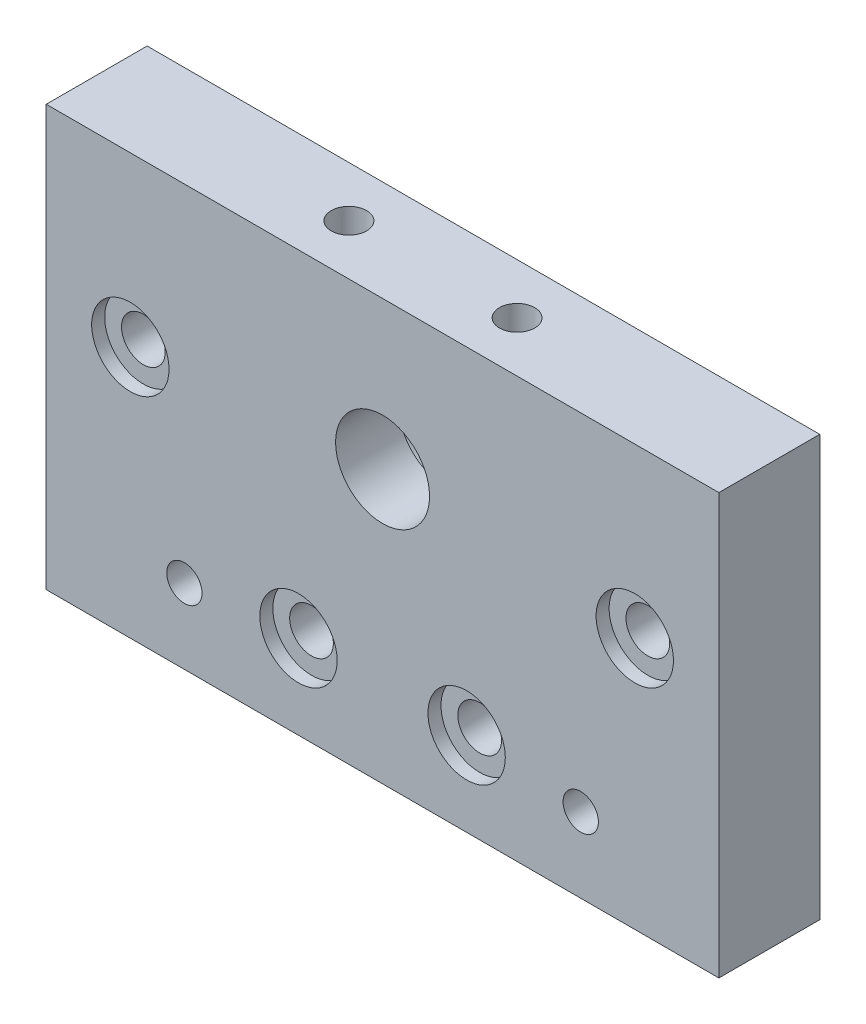
ISO-10303-21;
HEADER;
FILE_DESCRIPTION(('STEP AP214'),'2;1');
FILE_NAME('part.step','',(''),(''),'','','');
FILE_SCHEMA(('AUTOMOTIVE_DESIGN { 1 0 10303 214 1 1 1 1 }'));
ENDSEC;
DATA;
#1=APPLICATION_CONTEXT('core data for automotive mechanical design processes');
#2=APPLICATION_PROTOCOL_DEFINITION('international standard','automotive_design',2000,#1);
#3=PRODUCT_CONTEXT('',#1,'mechanical');
#4=PRODUCT('Part','Part','',(#3));
#5=PRODUCT_RELATED_PRODUCT_CATEGORY('part','',(#4));
#6=PRODUCT_DEFINITION_FORMATION('','',#4);
#7=PRODUCT_DEFINITION_CONTEXT('part definition',#1,'design');
#8=PRODUCT_DEFINITION('design','',#6,#7);
#9=PRODUCT_DEFINITION_SHAPE('','',#8);
#10=(LENGTH_UNIT() NAMED_UNIT(*) SI_UNIT(.MILLI.,.METRE.));
#11=(NAMED_UNIT(*) PLANE_ANGLE_UNIT() SI_UNIT($,.RADIAN.));
#12=(NAMED_UNIT(*) SI_UNIT($,.STERADIAN.) SOLID_ANGLE_UNIT());
#13=UNCERTAINTY_MEASURE_WITH_UNIT(LENGTH_MEASURE(1.E-05),#10,'distance_accuracy_value','');
#14=(GEOMETRIC_REPRESENTATION_CONTEXT(3) GLOBAL_UNCERTAINTY_ASSIGNED_CONTEXT((#13)) GLOBAL_UNIT_ASSIGNED_CONTEXT((#10,
#11,#12)) REPRESENTATION_CONTEXT('',''));
#15=CARTESIAN_POINT('',(0.,0.,0.));
#16=DIRECTION('',(0.,0.,1.));
#17=DIRECTION('',(1.,0.,0.));
#18=AXIS2_PLACEMENT_3D('',#15,#16,#17);
#19=CARTESIAN_POINT('',(40.,32.4,12.));
#20=DIRECTION('',(0.,0.,-1.));
#21=DIRECTION('',(-1.,0.,0.));
#22=AXIS2_PLACEMENT_3D('',#19,#20,#21);
#23=CYLINDRICAL_SURFACE('',#22,5.588);
#24=CARTESIAN_POINT('',(40.,32.4,12.));
#25=DIRECTION('',(0.,0.,1.));
#26=DIRECTION('',(1.,0.,0.));
#27=AXIS2_PLACEMENT_3D('',#24,#25,#26);
#28=CIRCLE('',#27,5.588);
#29=CARTESIAN_POINT('',(45.588,32.4,12.));
#30=VERTEX_POINT('',#29);
#31=EDGE_CURVE('E164',#30,#30,#28,.T.);
#32=ORIENTED_EDGE('',*,*,#31,.T.);
#33=EDGE_LOOP('',(#32));
#34=FACE_BOUND('',#33,.T.);
#35=CARTESIAN_POINT('',(40.,32.4,4.5));
#36=DIRECTION('',(0.,0.,-1.));
#37=DIRECTION('',(-1.,0.,0.));
#38=AXIS2_PLACEMENT_3D('',#35,#36,#37);
#39=CIRCLE('',#38,5.588);
#40=CARTESIAN_POINT('',(34.412,32.4,4.5));
#41=VERTEX_POINT('',#40);
#42=EDGE_CURVE('E37',#41,#41,#39,.T.);
#43=ORIENTED_EDGE('',*,*,#42,.T.);
#44=EDGE_LOOP('',(#43));
#45=FACE_BOUND('',#44,.T.);
#46=ADVANCED_FACE('F33',(#34,#45),#23,.F.);
#47=CARTESIAN_POINT('',(70.,30.,12.));
#48=DIRECTION('',(0.,0.,-1.));
#49=DIRECTION('',(-1.,0.,0.));
#50=AXIS2_PLACEMENT_3D('',#47,#48,#49);
#51=CYLINDRICAL_SURFACE('',#50,2.59999999999999);
#52=CARTESIAN_POINT('',(70.,30.,0.));
#53=DIRECTION('',(0.,0.,1.));
#54=DIRECTION('',(-1.,0.,0.));
#55=AXIS2_PLACEMENT_3D('',#52,#53,#54);
#56=CIRCLE('',#55,2.59999999999999);
#57=CARTESIAN_POINT('',(67.4,30.,0.));
#58=VERTEX_POINT('',#57);
#59=EDGE_CURVE('E152',#58,#58,#56,.T.);
#60=ORIENTED_EDGE('',*,*,#59,.F.);
#61=EDGE_LOOP('',(#60));
#62=FACE_BOUND('',#61,.T.);
#63=CARTESIAN_POINT('',(70.,30.,10.45));
#64=DIRECTION('',(0.,0.,1.));
#65=DIRECTION('',(1.,0.,0.));
#66=AXIS2_PLACEMENT_3D('',#63,#64,#65);
#67=CIRCLE('',#66,2.59999999999999);
#68=CARTESIAN_POINT('',(72.6,30.,10.45));
#69=VERTEX_POINT('',#68);
#70=EDGE_CURVE('E128',#69,#69,#67,.T.);
#71=ORIENTED_EDGE('',*,*,#70,.T.);
#72=EDGE_LOOP('',(#71));
#73=FACE_BOUND('',#72,.T.);
#74=ADVANCED_FACE('F193',(#62,#73),#51,.F.);
#75=CARTESIAN_POINT('',(50.,10.,12.));
#76=DIRECTION('',(0.,0.,-1.));
#77=DIRECTION('',(-1.,0.,0.));
#78=AXIS2_PLACEMENT_3D('',#75,#76,#77);
#79=CYLINDRICAL_SURFACE('',#78,2.59999999999999);
#80=CARTESIAN_POINT('',(50.,10.,0.));
#81=DIRECTION('',(0.,0.,1.));
#82=DIRECTION('',(-1.,0.,0.));
#83=AXIS2_PLACEMENT_3D('',#80,#81,#82);
#84=CIRCLE('',#83,2.59999999999999);
#85=CARTESIAN_POINT('',(47.4,10.,0.));
#86=VERTEX_POINT('',#85);
#87=EDGE_CURVE('E155',#86,#86,#84,.T.);
#88=ORIENTED_EDGE('',*,*,#87,.F.);
#89=EDGE_LOOP('',(#88));
#90=FACE_BOUND('',#89,.T.);
#91=CARTESIAN_POINT('',(50.,10.,10.45));
#92=DIRECTION('',(0.,0.,1.));
#93=DIRECTION('',(1.,0.,0.));
#94=AXIS2_PLACEMENT_3D('',#91,#92,#93);
#95=CIRCLE('',#94,2.59999999999999);
#96=CARTESIAN_POINT('',(52.6,10.,10.45));
#97=VERTEX_POINT('',#96);
#98=EDGE_CURVE('E134',#97,#97,#95,.T.);
#99=ORIENTED_EDGE('',*,*,#98,.T.);
#100=EDGE_LOOP('',(#99));
#101=FACE_BOUND('',#100,.T.);
#102=ADVANCED_FACE('F261',(#90,#101),#79,.F.);
#103=CARTESIAN_POINT('',(30.,10.,12.));
#104=DIRECTION('',(0.,0.,-1.));
#105=DIRECTION('',(-1.,0.,0.));
#106=AXIS2_PLACEMENT_3D('',#103,#104,#105);
#107=CYLINDRICAL_SURFACE('',#106,2.59999999999999);
#108=CARTESIAN_POINT('',(30.,10.,0.));
#109=DIRECTION('',(0.,0.,1.));
#110=DIRECTION('',(1.,0.,0.));
#111=AXIS2_PLACEMENT_3D('',#108,#109,#110);
#112=CIRCLE('',#111,2.59999999999999);
#113=CARTESIAN_POINT('',(32.6,10.,0.));
#114=VERTEX_POINT('',#113);
#115=EDGE_CURVE('E161',#114,#114,#112,.T.);
#116=ORIENTED_EDGE('',*,*,#115,.F.);
#117=EDGE_LOOP('',(#116));
#118=FACE_BOUND('',#117,.T.);
#119=CARTESIAN_POINT('',(30.,10.,10.45));
#120=DIRECTION('',(0.,0.,1.));
#121=DIRECTION('',(1.,0.,0.));
#122=AXIS2_PLACEMENT_3D('',#119,#120,#121);
#123=CIRCLE('',#122,2.59999999999999);
#124=CARTESIAN_POINT('',(32.6,10.,10.45));
#125=VERTEX_POINT('',#124);
#126=EDGE_CURVE('E141',#125,#125,#123,.T.);
#127=ORIENTED_EDGE('',*,*,#126,.T.);
#128=EDGE_LOOP('',(#127));
#129=FACE_BOUND('',#128,.T.);
#130=ADVANCED_FACE('F266',(#118,#129),#107,.F.);
#131=CARTESIAN_POINT('',(9.99999999999999,30.,12.));
#132=DIRECTION('',(0.,0.,-1.));
#133=DIRECTION('',(-1.,0.,0.));
#134=AXIS2_PLACEMENT_3D('',#131,#132,#133);
#135=CYLINDRICAL_SURFACE('',#134,2.6);
#136=CARTESIAN_POINT('',(9.99999999999999,30.,0.));
#137=DIRECTION('',(0.,0.,1.));
#138=DIRECTION('',(1.,0.,0.));
#139=AXIS2_PLACEMENT_3D('',#136,#137,#138);
#140=CIRCLE('',#139,2.6);
#141=CARTESIAN_POINT('',(12.6,30.,0.));
#142=VERTEX_POINT('',#141);
#143=EDGE_CURVE('E158',#142,#142,#140,.T.);
#144=ORIENTED_EDGE('',*,*,#143,.F.);
#145=EDGE_LOOP('',(#144));
#146=FACE_BOUND('',#145,.T.);
#147=CARTESIAN_POINT('',(9.99999999999999,30.,10.45));
#148=DIRECTION('',(0.,0.,1.));
#149=DIRECTION('',(1.,0.,0.));
#150=AXIS2_PLACEMENT_3D('',#147,#148,#149);
#151=CIRCLE('',#150,2.6);
#152=CARTESIAN_POINT('',(12.6,30.,10.45));
#153=VERTEX_POINT('',#152);
#154=EDGE_CURVE('E148',#153,#153,#151,.T.);
#155=ORIENTED_EDGE('',*,*,#154,.T.);
#156=EDGE_LOOP('',(#155));
#157=FACE_BOUND('',#156,.T.);
#158=ADVANCED_FACE('F213',(#146,#157),#135,.F.);
#159=CARTESIAN_POINT('',(0.,0.,12.));
#160=DIRECTION('',(0.,0.,-1.));
#161=DIRECTION('',(-1.,0.,0.));
#162=AXIS2_PLACEMENT_3D('',#159,#160,#161);
#163=PLANE('',#162);
#164=CARTESIAN_POINT('',(16.43,8.9,12.));
#165=DIRECTION('',(0.,0.,1.));
#166=DIRECTION('',(1.,0.,0.));
#167=AXIS2_PLACEMENT_3D('',#164,#165,#166);
#168=CIRCLE('',#167,2.09999999999999);
#169=CARTESIAN_POINT('',(18.53,8.9,12.));
#170=VERTEX_POINT('',#169);
#171=EDGE_CURVE('E112',#170,#170,#168,.T.);
#172=ORIENTED_EDGE('',*,*,#171,.F.);
#173=EDGE_LOOP('',(#172));
#174=FACE_BOUND('',#173,.T.);
#175=CARTESIAN_POINT('',(63.57,8.90000000000001,12.));
#176=DIRECTION('',(0.,0.,1.));
#177=DIRECTION('',(1.,0.,0.));
#178=AXIS2_PLACEMENT_3D('',#175,#176,#177);
#179=CIRCLE('',#178,2.09999999999999);
#180=CARTESIAN_POINT('',(65.67,8.90000000000001,12.));
#181=VERTEX_POINT('',#180);
#182=EDGE_CURVE('E118',#181,#181,#179,.T.);
#183=ORIENTED_EDGE('',*,*,#182,.F.);
#184=EDGE_LOOP('',(#183));
#185=FACE_BOUND('',#184,.T.);
#186=CARTESIAN_POINT('',(70.,30.,12.));
#187=DIRECTION('',(0.,0.,1.));
#188=DIRECTION('',(1.,0.,0.));
#189=AXIS2_PLACEMENT_3D('',#186,#187,#188);
#190=CIRCLE('',#189,4.6);
#191=CARTESIAN_POINT('',(74.6,30.,12.));
#192=VERTEX_POINT('',#191);
#193=EDGE_CURVE('E124',#192,#192,#190,.T.);
#194=ORIENTED_EDGE('',*,*,#193,.F.);
#195=EDGE_LOOP('',(#194));
#196=FACE_BOUND('',#195,.T.);
#197=CARTESIAN_POINT('',(50.,10.,12.));
#198=DIRECTION('',(0.,0.,1.));
#199=DIRECTION('',(1.,0.,0.));
#200=AXIS2_PLACEMENT_3D('',#197,#198,#199);
#201=CIRCLE('',#200,4.6);
#202=CARTESIAN_POINT('',(54.6,10.,12.));
#203=VERTEX_POINT('',#202);
#204=EDGE_CURVE('E135',#203,#203,#201,.T.);
#205=ORIENTED_EDGE('',*,*,#204,.F.);
#206=EDGE_LOOP('',(#205));
#207=FACE_BOUND('',#206,.T.);
#208=CARTESIAN_POINT('',(30.,10.,12.));
#209=DIRECTION('',(0.,0.,1.));
#210=DIRECTION('',(1.,0.,0.));
#211=AXIS2_PLACEMENT_3D('',#208,#209,#210);
#212=CIRCLE('',#211,4.6);
#213=CARTESIAN_POINT('',(34.6,10.,12.));
#214=VERTEX_POINT('',#213);
#215=EDGE_CURVE('E142',#214,#214,#212,.T.);
#216=ORIENTED_EDGE('',*,*,#215,.F.);
#217=EDGE_LOOP('',(#216));
#218=FACE_BOUND('',#217,.T.);
#219=CARTESIAN_POINT('',(9.99999999999999,30.,12.));
#220=DIRECTION('',(0.,0.,1.));
#221=DIRECTION('',(1.,0.,0.));
#222=AXIS2_PLACEMENT_3D('',#219,#220,#221);
#223=CIRCLE('',#222,4.6);
#224=CARTESIAN_POINT('',(14.6,30.,12.));
#225=VERTEX_POINT('',#224);
#226=EDGE_CURVE('E149',#225,#225,#223,.T.);
#227=ORIENTED_EDGE('',*,*,#226,.F.);
#228=EDGE_LOOP('',(#227));
#229=FACE_BOUND('',#228,.T.);
#230=DIRECTION('',(0.,-1.,0.));
#231=VECTOR('',#230,1.);
#232=CARTESIAN_POINT('',(0.,0.,12.));
#233=LINE('',#232,#231);
#234=CARTESIAN_POINT('',(0.,50.,12.));
#235=VERTEX_POINT('',#234);
#236=CARTESIAN_POINT('',(0.,0.,12.));
#237=VERTEX_POINT('',#236);
#238=EDGE_CURVE('E168',#235,#237,#233,.T.);
#239=ORIENTED_EDGE('',*,*,#238,.T.);
#240=DIRECTION('',(1.,0.,0.));
#241=VECTOR('',#240,1.);
#242=CARTESIAN_POINT('',(0.,0.,12.));
#243=LINE('',#242,#241);
#244=CARTESIAN_POINT('',(80.,0.,12.));
#245=VERTEX_POINT('',#244);
#246=EDGE_CURVE('E83',#237,#245,#243,.T.);
#247=ORIENTED_EDGE('',*,*,#246,.T.);
#248=DIRECTION('',(0.,1.,0.));
#249=VECTOR('',#248,1.);
#250=CARTESIAN_POINT('',(80.,0.,12.));
#251=LINE('',#250,#249);
#252=CARTESIAN_POINT('',(80.,50.,12.));
#253=VERTEX_POINT('',#252);
#254=EDGE_CURVE('E171',#245,#253,#251,.T.);
#255=ORIENTED_EDGE('',*,*,#254,.T.);
#256=DIRECTION('',(-1.,0.,0.));
#257=VECTOR('',#256,1.);
#258=CARTESIAN_POINT('',(0.,50.,12.));
#259=LINE('',#258,#257);
#260=EDGE_CURVE('E52',#253,#235,#259,.T.);
#261=ORIENTED_EDGE('',*,*,#260,.T.);
#262=EDGE_LOOP('',(#239,#247,#255,#261));
#263=FACE_BOUND('',#262,.T.);
#264=ORIENTED_EDGE('',*,*,#31,.F.);
#265=EDGE_LOOP('',(#264));
#266=FACE_BOUND('',#265,.T.);
#267=ADVANCED_FACE('F209',(#174,#185,#196,#207,#218,#229,#263,#266),#163,.F.);
#268=CARTESIAN_POINT('',(0.,0.,0.));
#269=DIRECTION('',(0.,0.,-1.));
#270=DIRECTION('',(-1.,0.,0.));
#271=AXIS2_PLACEMENT_3D('',#268,#269,#270);
#272=PLANE('',#271);
#273=CARTESIAN_POINT('',(40.,32.4,0.));
#274=DIRECTION('',(0.,0.,-1.));
#275=DIRECTION('',(-1.,0.,0.));
#276=AXIS2_PLACEMENT_3D('',#273,#274,#275);
#277=CIRCLE('',#276,8.05);
#278=CARTESIAN_POINT('',(31.95,32.4,0.));
#279=VERTEX_POINT('',#278);
#280=EDGE_CURVE('E234',#279,#279,#277,.T.);
#281=ORIENTED_EDGE('',*,*,#280,.F.);
#282=EDGE_LOOP('',(#281));
#283=FACE_BOUND('',#282,.T.);
#284=CARTESIAN_POINT('',(16.43,8.9,0.));
#285=DIRECTION('',(0.,0.,1.));
#286=DIRECTION('',(1.,0.,0.));
#287=AXIS2_PLACEMENT_3D('',#284,#285,#286);
#288=CIRCLE('',#287,2.1);
#289=CARTESIAN_POINT('',(18.53,8.9,0.));
#290=VERTEX_POINT('',#289);
#291=EDGE_CURVE('E115',#290,#290,#288,.T.);
#292=ORIENTED_EDGE('',*,*,#291,.T.);
#293=EDGE_LOOP('',(#292));
#294=FACE_BOUND('',#293,.T.);
#295=CARTESIAN_POINT('',(63.57,8.90000000000001,0.));
#296=DIRECTION('',(0.,0.,1.));
#297=DIRECTION('',(1.,0.,0.));
#298=AXIS2_PLACEMENT_3D('',#295,#296,#297);
#299=CIRCLE('',#298,2.1);
#300=CARTESIAN_POINT('',(65.67,8.90000000000001,0.));
#301=VERTEX_POINT('',#300);
#302=EDGE_CURVE('E121',#301,#301,#299,.T.);
#303=ORIENTED_EDGE('',*,*,#302,.T.);
#304=EDGE_LOOP('',(#303));
#305=FACE_BOUND('',#304,.T.);
#306=ORIENTED_EDGE('',*,*,#87,.T.);
#307=EDGE_LOOP('',(#306));
#308=FACE_BOUND('',#307,.T.);
#309=ORIENTED_EDGE('',*,*,#115,.T.);
#310=EDGE_LOOP('',(#309));
#311=FACE_BOUND('',#310,.T.);
#312=DIRECTION('',(0.,-1.,0.));
#313=VECTOR('',#312,1.);
#314=CARTESIAN_POINT('',(0.,0.,0.));
#315=LINE('',#314,#313);
#316=CARTESIAN_POINT('',(0.,50.,0.));
#317=VERTEX_POINT('',#316);
#318=CARTESIAN_POINT('',(0.,0.,0.));
#319=VERTEX_POINT('',#318);
#320=EDGE_CURVE('E167',#317,#319,#315,.T.);
#321=ORIENTED_EDGE('',*,*,#320,.F.);
#322=DIRECTION('',(-1.,0.,0.));
#323=VECTOR('',#322,1.);
#324=CARTESIAN_POINT('',(0.,50.,0.));
#325=LINE('',#324,#323);
#326=CARTESIAN_POINT('',(80.,50.,0.));
#327=VERTEX_POINT('',#326);
#328=EDGE_CURVE('E76',#327,#317,#325,.T.);
#329=ORIENTED_EDGE('',*,*,#328,.F.);
#330=DIRECTION('',(0.,1.,0.));
#331=VECTOR('',#330,1.);
#332=CARTESIAN_POINT('',(80.,0.,0.));
#333=LINE('',#332,#331);
#334=CARTESIAN_POINT('',(80.,0.,0.));
#335=VERTEX_POINT('',#334);
#336=EDGE_CURVE('E70',#335,#327,#333,.T.);
#337=ORIENTED_EDGE('',*,*,#336,.F.);
#338=DIRECTION('',(1.,0.,0.));
#339=VECTOR('',#338,1.);
#340=CARTESIAN_POINT('',(0.,0.,0.));
#341=LINE('',#340,#339);
#342=EDGE_CURVE('E177',#319,#335,#341,.T.);
#343=ORIENTED_EDGE('',*,*,#342,.F.);
#344=EDGE_LOOP('',(#321,#329,#337,#343));
#345=FACE_BOUND('',#344,.T.);
#346=ORIENTED_EDGE('',*,*,#143,.T.);
#347=EDGE_LOOP('',(#346));
#348=FACE_BOUND('',#347,.T.);
#349=ORIENTED_EDGE('',*,*,#59,.T.);
#350=EDGE_LOOP('',(#349));
#351=FACE_BOUND('',#350,.T.);
#352=ADVANCED_FACE('F212',(#283,#294,#305,#308,#311,#345,#348,#351),#272,.T.);
#353=CARTESIAN_POINT('',(0.,0.,12.));
#354=DIRECTION('',(1.,0.,0.));
#355=DIRECTION('',(0.,0.,-1.));
#356=AXIS2_PLACEMENT_3D('',#353,#354,#355);
#357=PLANE('',#356);
#358=ORIENTED_EDGE('',*,*,#320,.T.);
#359=DIRECTION('',(0.,0.,-1.));
#360=VECTOR('',#359,1.);
#361=CARTESIAN_POINT('',(0.,0.,12.));
#362=LINE('',#361,#360);
#363=EDGE_CURVE('E11',#237,#319,#362,.T.);
#364=ORIENTED_EDGE('',*,*,#363,.F.);
#365=ORIENTED_EDGE('',*,*,#238,.F.);
#366=DIRECTION('',(0.,0.,-1.));
#367=VECTOR('',#366,1.);
#368=CARTESIAN_POINT('',(0.,50.,12.));
#369=LINE('',#368,#367);
#370=EDGE_CURVE('E174',#235,#317,#369,.T.);
#371=ORIENTED_EDGE('',*,*,#370,.T.);
#372=EDGE_LOOP('',(#358,#364,#365,#371));
#373=FACE_BOUND('',#372,.T.);
#374=ADVANCED_FACE('F35',(#373),#357,.F.);
#375=CARTESIAN_POINT('',(0.,0.,12.));
#376=DIRECTION('',(0.,1.,0.));
#377=DIRECTION('',(0.,0.,1.));
#378=AXIS2_PLACEMENT_3D('',#375,#376,#377);
#379=PLANE('',#378);
#380=ORIENTED_EDGE('',*,*,#342,.T.);
#381=DIRECTION('',(0.,0.,-1.));
#382=VECTOR('',#381,1.);
#383=CARTESIAN_POINT('',(80.,0.,12.));
#384=LINE('',#383,#382);
#385=EDGE_CURVE('E43',#245,#335,#384,.T.);
#386=ORIENTED_EDGE('',*,*,#385,.F.);
#387=ORIENTED_EDGE('',*,*,#246,.F.);
#388=ORIENTED_EDGE('',*,*,#363,.T.);
#389=EDGE_LOOP('',(#380,#386,#387,#388));
#390=FACE_BOUND('',#389,.T.);
#391=ADVANCED_FACE('F285',(#390),#379,.F.);
#392=CARTESIAN_POINT('',(80.,0.,12.));
#393=DIRECTION('',(-1.,0.,0.));
#394=DIRECTION('',(0.,0.,1.));
#395=AXIS2_PLACEMENT_3D('',#392,#393,#394);
#396=PLANE('',#395);
#397=ORIENTED_EDGE('',*,*,#336,.T.);
#398=DIRECTION('',(0.,0.,-1.));
#399=VECTOR('',#398,1.);
#400=CARTESIAN_POINT('',(80.,50.,12.));
#401=LINE('',#400,#399);
#402=EDGE_CURVE('E182',#253,#327,#401,.T.);
#403=ORIENTED_EDGE('',*,*,#402,.F.);
#404=ORIENTED_EDGE('',*,*,#254,.F.);
#405=ORIENTED_EDGE('',*,*,#385,.T.);
#406=EDGE_LOOP('',(#397,#403,#404,#405));
#407=FACE_BOUND('',#406,.T.);
#408=ADVANCED_FACE('F282',(#407),#396,.F.);
#409=CARTESIAN_POINT('',(0.,50.,12.));
#410=DIRECTION('',(0.,-1.,0.));
#411=DIRECTION('',(0.,0.,-1.));
#412=AXIS2_PLACEMENT_3D('',#409,#410,#411);
#413=PLANE('',#412);
#414=CARTESIAN_POINT('',(30.,50.,6.));
#415=DIRECTION('',(0.,1.,0.));
#416=DIRECTION('',(0.,0.,1.));
#417=AXIS2_PLACEMENT_3D('',#414,#415,#416);
#418=CIRCLE('',#417,2.09999999999999);
#419=CARTESIAN_POINT('',(30.,50.,8.09999999999999));
#420=VERTEX_POINT('',#419);
#421=EDGE_CURVE('E101',#420,#420,#418,.T.);
#422=ORIENTED_EDGE('',*,*,#421,.F.);
#423=EDGE_LOOP('',(#422));
#424=FACE_BOUND('',#423,.T.);
#425=CARTESIAN_POINT('',(50.,50.,6.));
#426=DIRECTION('',(0.,1.,0.));
#427=DIRECTION('',(0.,0.,1.));
#428=AXIS2_PLACEMENT_3D('',#425,#426,#427);
#429=CIRCLE('',#428,2.09999999999999);
#430=CARTESIAN_POINT('',(50.,50.,8.09999999999999));
#431=VERTEX_POINT('',#430);
#432=EDGE_CURVE('E100',#431,#431,#429,.T.);
#433=ORIENTED_EDGE('',*,*,#432,.F.);
#434=EDGE_LOOP('',(#433));
#435=FACE_BOUND('',#434,.T.);
#436=ORIENTED_EDGE('',*,*,#328,.T.);
#437=ORIENTED_EDGE('',*,*,#370,.F.);
#438=ORIENTED_EDGE('',*,*,#260,.F.);
#439=ORIENTED_EDGE('',*,*,#402,.T.);
#440=EDGE_LOOP('',(#436,#437,#438,#439));
#441=FACE_BOUND('',#440,.T.);
#442=ADVANCED_FACE('F279',(#424,#435,#441),#413,.F.);
#443=CARTESIAN_POINT('',(9.99999999999999,30.,10.45));
#444=DIRECTION('',(0.,0.,1.));
#445=DIRECTION('',(1.,0.,0.));
#446=AXIS2_PLACEMENT_3D('',#443,#444,#445);
#447=CYLINDRICAL_SURFACE('',#446,4.6);
#448=CARTESIAN_POINT('',(9.99999999999999,30.,10.45));
#449=DIRECTION('',(0.,0.,1.));
#450=DIRECTION('',(1.,0.,0.));
#451=AXIS2_PLACEMENT_3D('',#448,#449,#450);
#452=CIRCLE('',#451,4.6);
#453=CARTESIAN_POINT('',(14.6,30.,10.45));
#454=VERTEX_POINT('',#453);
#455=EDGE_CURVE('E145',#454,#454,#452,.T.);
#456=ORIENTED_EDGE('',*,*,#455,.F.);
#457=EDGE_LOOP('',(#456));
#458=FACE_BOUND('',#457,.T.);
#459=ORIENTED_EDGE('',*,*,#226,.T.);
#460=EDGE_LOOP('',(#459));
#461=FACE_BOUND('',#460,.T.);
#462=ADVANCED_FACE('F270',(#458,#461),#447,.F.);
#463=CARTESIAN_POINT('',(9.99999999999999,30.,10.45));
#464=DIRECTION('',(0.,0.,1.));
#465=DIRECTION('',(1.,0.,0.));
#466=AXIS2_PLACEMENT_3D('',#463,#464,#465);
#467=PLANE('',#466);
#468=ORIENTED_EDGE('',*,*,#154,.F.);
#469=EDGE_LOOP('',(#468));
#470=FACE_BOUND('',#469,.T.);
#471=ORIENTED_EDGE('',*,*,#455,.T.);
#472=EDGE_LOOP('',(#471));
#473=FACE_BOUND('',#472,.T.);
#474=ADVANCED_FACE('F353',(#470,#473),#467,.T.);
#475=CARTESIAN_POINT('',(30.,10.,10.45));
#476=DIRECTION('',(0.,0.,1.));
#477=DIRECTION('',(1.,0.,0.));
#478=AXIS2_PLACEMENT_3D('',#475,#476,#477);
#479=CYLINDRICAL_SURFACE('',#478,4.6);
#480=CARTESIAN_POINT('',(30.,10.,10.45));
#481=DIRECTION('',(0.,0.,1.));
#482=DIRECTION('',(1.,0.,0.));
#483=AXIS2_PLACEMENT_3D('',#480,#481,#482);
#484=CIRCLE('',#483,4.6);
#485=CARTESIAN_POINT('',(34.6,10.,10.45));
#486=VERTEX_POINT('',#485);
#487=EDGE_CURVE('E138',#486,#486,#484,.T.);
#488=ORIENTED_EDGE('',*,*,#487,.F.);
#489=EDGE_LOOP('',(#488));
#490=FACE_BOUND('',#489,.T.);
#491=ORIENTED_EDGE('',*,*,#215,.T.);
#492=EDGE_LOOP('',(#491));
#493=FACE_BOUND('',#492,.T.);
#494=ADVANCED_FACE('F359',(#490,#493),#479,.F.);
#495=CARTESIAN_POINT('',(30.,10.,10.45));
#496=DIRECTION('',(0.,0.,1.));
#497=DIRECTION('',(1.,0.,0.));
#498=AXIS2_PLACEMENT_3D('',#495,#496,#497);
#499=PLANE('',#498);
#500=ORIENTED_EDGE('',*,*,#126,.F.);
#501=EDGE_LOOP('',(#500));
#502=FACE_BOUND('',#501,.T.);
#503=ORIENTED_EDGE('',*,*,#487,.T.);
#504=EDGE_LOOP('',(#503));
#505=FACE_BOUND('',#504,.T.);
#506=ADVANCED_FACE('F366',(#502,#505),#499,.T.);
#507=CARTESIAN_POINT('',(50.,10.,10.45));
#508=DIRECTION('',(0.,0.,1.));
#509=DIRECTION('',(1.,0.,0.));
#510=AXIS2_PLACEMENT_3D('',#507,#508,#509);
#511=CYLINDRICAL_SURFACE('',#510,4.6);
#512=CARTESIAN_POINT('',(50.,10.,10.45));
#513=DIRECTION('',(0.,0.,1.));
#514=DIRECTION('',(1.,0.,0.));
#515=AXIS2_PLACEMENT_3D('',#512,#513,#514);
#516=CIRCLE('',#515,4.6);
#517=CARTESIAN_POINT('',(54.6,10.,10.45));
#518=VERTEX_POINT('',#517);
#519=EDGE_CURVE('E131',#518,#518,#516,.T.);
#520=ORIENTED_EDGE('',*,*,#519,.F.);
#521=EDGE_LOOP('',(#520));
#522=FACE_BOUND('',#521,.T.);
#523=ORIENTED_EDGE('',*,*,#204,.T.);
#524=EDGE_LOOP('',(#523));
#525=FACE_BOUND('',#524,.T.);
#526=ADVANCED_FACE('F374',(#522,#525),#511,.F.);
#527=CARTESIAN_POINT('',(50.,10.,10.45));
#528=DIRECTION('',(0.,0.,1.));
#529=DIRECTION('',(1.,0.,0.));
#530=AXIS2_PLACEMENT_3D('',#527,#528,#529);
#531=PLANE('',#530);
#532=ORIENTED_EDGE('',*,*,#98,.F.);
#533=EDGE_LOOP('',(#532));
#534=FACE_BOUND('',#533,.T.);
#535=ORIENTED_EDGE('',*,*,#519,.T.);
#536=EDGE_LOOP('',(#535));
#537=FACE_BOUND('',#536,.T.);
#538=ADVANCED_FACE('F205',(#534,#537),#531,.T.);
#539=CARTESIAN_POINT('',(70.,30.,10.45));
#540=DIRECTION('',(0.,0.,1.));
#541=DIRECTION('',(1.,0.,0.));
#542=AXIS2_PLACEMENT_3D('',#539,#540,#541);
#543=CYLINDRICAL_SURFACE('',#542,4.6);
#544=CARTESIAN_POINT('',(70.,30.,10.45));
#545=DIRECTION('',(0.,0.,1.));
#546=DIRECTION('',(1.,0.,0.));
#547=AXIS2_PLACEMENT_3D('',#544,#545,#546);
#548=CIRCLE('',#547,4.6);
#549=CARTESIAN_POINT('',(74.6,30.,10.45));
#550=VERTEX_POINT('',#549);
#551=EDGE_CURVE('E125',#550,#550,#548,.T.);
#552=ORIENTED_EDGE('',*,*,#551,.F.);
#553=EDGE_LOOP('',(#552));
#554=FACE_BOUND('',#553,.T.);
#555=ORIENTED_EDGE('',*,*,#193,.T.);
#556=EDGE_LOOP('',(#555));
#557=FACE_BOUND('',#556,.T.);
#558=ADVANCED_FACE('F199',(#554,#557),#543,.F.);
#559=CARTESIAN_POINT('',(70.,30.,10.45));
#560=DIRECTION('',(0.,0.,1.));
#561=DIRECTION('',(1.,0.,0.));
#562=AXIS2_PLACEMENT_3D('',#559,#560,#561);
#563=PLANE('',#562);
#564=ORIENTED_EDGE('',*,*,#70,.F.);
#565=EDGE_LOOP('',(#564));
#566=FACE_BOUND('',#565,.T.);
#567=ORIENTED_EDGE('',*,*,#551,.T.);
#568=EDGE_LOOP('',(#567));
#569=FACE_BOUND('',#568,.T.);
#570=ADVANCED_FACE('F195',(#566,#569),#563,.T.);
#571=CARTESIAN_POINT('',(63.57,8.90000000000001,12.));
#572=DIRECTION('',(0.,0.,1.));
#573=DIRECTION('',(1.,0.,0.));
#574=AXIS2_PLACEMENT_3D('',#571,#572,#573);
#575=CYLINDRICAL_SURFACE('',#574,2.1);
#576=ORIENTED_EDGE('',*,*,#302,.F.);
#577=EDGE_LOOP('',(#576));
#578=FACE_BOUND('',#577,.T.);
#579=ORIENTED_EDGE('',*,*,#182,.T.);
#580=EDGE_LOOP('',(#579));
#581=FACE_BOUND('',#580,.T.);
#582=ADVANCED_FACE('F198',(#578,#581),#575,.F.);
#583=CARTESIAN_POINT('',(16.43,8.9,12.));
#584=DIRECTION('',(0.,0.,1.));
#585=DIRECTION('',(1.,0.,0.));
#586=AXIS2_PLACEMENT_3D('',#583,#584,#585);
#587=CYLINDRICAL_SURFACE('',#586,2.09999999999999);
#588=ORIENTED_EDGE('',*,*,#291,.F.);
#589=EDGE_LOOP('',(#588));
#590=FACE_BOUND('',#589,.T.);
#591=ORIENTED_EDGE('',*,*,#171,.T.);
#592=EDGE_LOOP('',(#591));
#593=FACE_BOUND('',#592,.T.);
#594=ADVANCED_FACE('F402',(#590,#593),#587,.F.);
#595=CARTESIAN_POINT('',(50.,36.,6.));
#596=DIRECTION('',(0.,1.,0.));
#597=DIRECTION('',(0.,0.,1.));
#598=AXIS2_PLACEMENT_3D('',#595,#596,#597);
#599=CONICAL_SURFACE('',#598,2.09999999999998,1.02974425867665);
#600=CARTESIAN_POINT('',(50.,34.7381927000421,6.));
#601=VERTEX_POINT('',#600);
#602=VERTEX_LOOP('',#601);
#603=FACE_BOUND('',#602,.T.);
#604=CARTESIAN_POINT('',(50.,36.,6.));
#605=DIRECTION('',(0.,1.,0.));
#606=DIRECTION('',(0.,0.,1.));
#607=AXIS2_PLACEMENT_3D('',#604,#605,#606);
#608=CIRCLE('',#607,2.09999999999998);
#609=CARTESIAN_POINT('',(50.,36.,8.09999999999998));
#610=VERTEX_POINT('',#609);
#611=EDGE_CURVE('E104',#610,#610,#608,.T.);
#612=ORIENTED_EDGE('',*,*,#611,.T.);
#613=EDGE_LOOP('',(#612));
#614=FACE_BOUND('',#613,.T.);
#615=ADVANCED_FACE('F409',(#603,#614),#599,.F.);
#616=CARTESIAN_POINT('',(50.,50.,6.));
#617=DIRECTION('',(0.,1.,0.));
#618=DIRECTION('',(0.,0.,1.));
#619=AXIS2_PLACEMENT_3D('',#616,#617,#618);
#620=CYLINDRICAL_SURFACE('',#619,2.09999999999999);
#621=ORIENTED_EDGE('',*,*,#611,.F.);
#622=EDGE_LOOP('',(#621));
#623=FACE_BOUND('',#622,.T.);
#624=ORIENTED_EDGE('',*,*,#432,.T.);
#625=EDGE_LOOP('',(#624));
#626=FACE_BOUND('',#625,.T.);
#627=ADVANCED_FACE('F94',(#623,#626),#620,.F.);
#628=CARTESIAN_POINT('',(30.,36.,6.));
#629=DIRECTION('',(0.,1.,0.));
#630=DIRECTION('',(0.,0.,1.));
#631=AXIS2_PLACEMENT_3D('',#628,#629,#630);
#632=CONICAL_SURFACE('',#631,2.09999999999998,1.02974425867665);
#633=CARTESIAN_POINT('',(30.,34.7381927000421,6.));
#634=VERTEX_POINT('',#633);
#635=VERTEX_LOOP('',#634);
#636=FACE_BOUND('',#635,.T.);
#637=CARTESIAN_POINT('',(30.,36.,6.));
#638=DIRECTION('',(0.,1.,0.));
#639=DIRECTION('',(0.,0.,1.));
#640=AXIS2_PLACEMENT_3D('',#637,#638,#639);
#641=CIRCLE('',#640,2.09999999999998);
#642=CARTESIAN_POINT('',(30.,36.,8.09999999999998));
#643=VERTEX_POINT('',#642);
#644=EDGE_CURVE('E98',#643,#643,#641,.T.);
#645=ORIENTED_EDGE('',*,*,#644,.T.);
#646=EDGE_LOOP('',(#645));
#647=FACE_BOUND('',#646,.T.);
#648=ADVANCED_FACE('F90',(#636,#647),#632,.F.);
#649=CARTESIAN_POINT('',(30.,50.,6.));
#650=DIRECTION('',(0.,1.,0.));
#651=DIRECTION('',(0.,0.,1.));
#652=AXIS2_PLACEMENT_3D('',#649,#650,#651);
#653=CYLINDRICAL_SURFACE('',#652,2.09999999999999);
#654=ORIENTED_EDGE('',*,*,#644,.F.);
#655=EDGE_LOOP('',(#654));
#656=FACE_BOUND('',#655,.T.);
#657=ORIENTED_EDGE('',*,*,#421,.T.);
#658=EDGE_LOOP('',(#657));
#659=FACE_BOUND('',#658,.T.);
#660=ADVANCED_FACE('F93',(#656,#659),#653,.F.);
#661=CARTESIAN_POINT('',(40.,32.4,4.5));
#662=DIRECTION('',(0.,0.,-1.));
#663=DIRECTION('',(-1.,0.,0.));
#664=AXIS2_PLACEMENT_3D('',#661,#662,#663);
#665=CYLINDRICAL_SURFACE('',#664,8.05);
#666=CARTESIAN_POINT('',(40.,32.4,4.5));
#667=DIRECTION('',(0.,0.,-1.));
#668=DIRECTION('',(-1.,0.,0.));
#669=AXIS2_PLACEMENT_3D('',#666,#667,#668);
#670=CIRCLE('',#669,8.05);
#671=CARTESIAN_POINT('',(31.95,32.4,4.5));
#672=VERTEX_POINT('',#671);
#673=EDGE_CURVE('E232',#672,#672,#670,.T.);
#674=ORIENTED_EDGE('',*,*,#673,.F.);
#675=EDGE_LOOP('',(#674));
#676=FACE_BOUND('',#675,.T.);
#677=ORIENTED_EDGE('',*,*,#280,.T.);
#678=EDGE_LOOP('',(#677));
#679=FACE_BOUND('',#678,.T.);
#680=ADVANCED_FACE('F241',(#676,#679),#665,.F.);
#681=CARTESIAN_POINT('',(40.,32.4,4.5));
#682=DIRECTION('',(0.,0.,-1.));
#683=DIRECTION('',(-1.,0.,0.));
#684=AXIS2_PLACEMENT_3D('',#681,#682,#683);
#685=PLANE('',#684);
#686=ORIENTED_EDGE('',*,*,#42,.F.);
#687=EDGE_LOOP('',(#686));
#688=FACE_BOUND('',#687,.T.);
#689=ORIENTED_EDGE('',*,*,#673,.T.);
#690=EDGE_LOOP('',(#689));
#691=FACE_BOUND('',#690,.T.);
#692=ADVANCED_FACE('F439',(#688,#691),#685,.T.);
#693=CLOSED_SHELL('',(#46,#74,#102,#130,#158,#267,#352,#374,#391,#408,#442,#462,#474,#494,#506,
#526,#538,#558,#570,#582,#594,#615,#627,#648,#660,#680,#692));
#694=MANIFOLD_SOLID_BREP('B2',#693);
#695=ADVANCED_BREP_SHAPE_REPRESENTATION('',(#18,#694),#14);
#696=SHAPE_DEFINITION_REPRESENTATION(#9,#695);
ENDSEC;
END-ISO-10303-21;
